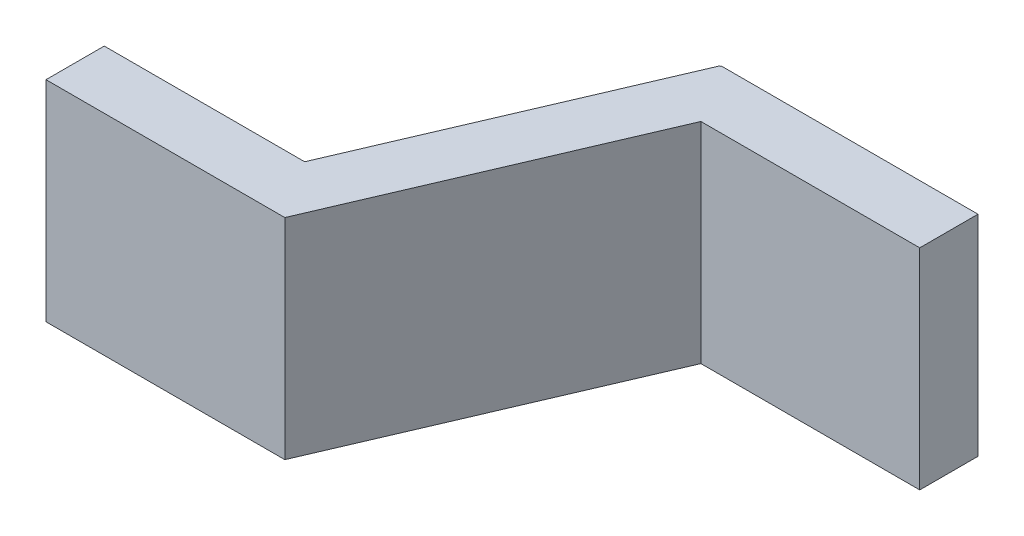
ISO-10303-21;
HEADER;
FILE_DESCRIPTION(('STEP AP214'),'2;1');
FILE_NAME('part.step','',(''),(''),'','','');
FILE_SCHEMA(('AUTOMOTIVE_DESIGN { 1 0 10303 214 1 1 1 1 }'));
ENDSEC;
DATA;
#1=APPLICATION_CONTEXT('core data for automotive mechanical design processes');
#2=APPLICATION_PROTOCOL_DEFINITION('international standard','automotive_design',2000,#1);
#3=PRODUCT_CONTEXT('',#1,'mechanical');
#4=PRODUCT('Part','Part','',(#3));
#5=PRODUCT_RELATED_PRODUCT_CATEGORY('part','',(#4));
#6=PRODUCT_DEFINITION_FORMATION('','',#4);
#7=PRODUCT_DEFINITION_CONTEXT('part definition',#1,'design');
#8=PRODUCT_DEFINITION('design','',#6,#7);
#9=PRODUCT_DEFINITION_SHAPE('','',#8);
#10=(LENGTH_UNIT() NAMED_UNIT(*) SI_UNIT(.MILLI.,.METRE.));
#11=(NAMED_UNIT(*) PLANE_ANGLE_UNIT() SI_UNIT($,.RADIAN.));
#12=(NAMED_UNIT(*) SI_UNIT($,.STERADIAN.) SOLID_ANGLE_UNIT());
#13=UNCERTAINTY_MEASURE_WITH_UNIT(LENGTH_MEASURE(1.E-05),#10,'distance_accuracy_value','');
#14=(GEOMETRIC_REPRESENTATION_CONTEXT(3) GLOBAL_UNCERTAINTY_ASSIGNED_CONTEXT((#13)) GLOBAL_UNIT_ASSIGNED_CONTEXT((#10,
#11,#12)) REPRESENTATION_CONTEXT('',''));
#15=CARTESIAN_POINT('',(0.,0.,0.));
#16=DIRECTION('',(0.,0.,1.));
#17=DIRECTION('',(1.,0.,0.));
#18=AXIS2_PLACEMENT_3D('',#15,#16,#17);
#19=CARTESIAN_POINT('',(11.558086453539,6.62,0.0006058345056003));
#20=DIRECTION('',(-0.919135450912914,0.,-0.393941649073963));
#21=DIRECTION('',(-0.393941649073963,0.,0.919135450912914));
#22=AXIS2_PLACEMENT_3D('',#19,#20,#21);
#23=PLANE('',#22);
#24=DIRECTION('',(0.,1.,0.));
#25=VECTOR('',#24,1.);
#26=CARTESIAN_POINT('',(11.344046008361,6.62,0.5));
#27=LINE('',#26,#25);
#28=CARTESIAN_POINT('',(11.344046008361,6.62,0.5));
#29=VERTEX_POINT('',#28);
#30=CARTESIAN_POINT('',(11.344046008361,6.980000014305,0.5));
#31=VERTEX_POINT('',#30);
#32=EDGE_CURVE('E94',#29,#31,#27,.T.);
#33=ORIENTED_EDGE('',*,*,#32,.T.);
#34=DIRECTION('',(-0.393941649073123,0.,0.919135450913275));
#35=VECTOR('',#34,1.);
#36=CARTESIAN_POINT('',(11.558086453539,6.980000014305,0.000605834505600302));
#37=LINE('',#36,#35);
#38=CARTESIAN_POINT('',(11.558086453539,6.980000014305,0.000605834505577237));
#39=VERTEX_POINT('',#38);
#40=EDGE_CURVE('E121',#39,#31,#37,.T.);
#41=ORIENTED_EDGE('',*,*,#40,.F.);
#42=DIRECTION('',(0.,1.,0.));
#43=VECTOR('',#42,1.);
#44=CARTESIAN_POINT('',(11.558086453539,6.62,0.000605834505554305));
#45=LINE('',#44,#43);
#46=CARTESIAN_POINT('',(11.558086453539,6.62,0.000605834505584969));
#47=VERTEX_POINT('',#46);
#48=EDGE_CURVE('E110',#39,#47,#45,.F.);
#49=ORIENTED_EDGE('',*,*,#48,.T.);
#50=DIRECTION('',(-0.393941649073123,0.,0.919135450913275));
#51=VECTOR('',#50,1.);
#52=CARTESIAN_POINT('',(11.558086453539,6.62,0.000605834505600302));
#53=LINE('',#52,#51);
#54=EDGE_CURVE('E100',#47,#29,#53,.T.);
#55=ORIENTED_EDGE('',*,*,#54,.T.);
#56=EDGE_LOOP('',(#33,#41,#49,#55));
#57=FACE_BOUND('',#56,.T.);
#58=ADVANCED_FACE('F17',(#57),#23,.T.);
#59=CARTESIAN_POINT('',(11.,6.62,0.5));
#60=DIRECTION('',(0.,0.,1.));
#61=DIRECTION('',(1.,0.,0.));
#62=AXIS2_PLACEMENT_3D('',#59,#60,#61);
#63=PLANE('',#62);
#64=DIRECTION('',(1.,0.,0.));
#65=VECTOR('',#64,1.);
#66=CARTESIAN_POINT('',(11.65,6.980000014305,0.5));
#67=LINE('',#66,#65);
#68=CARTESIAN_POINT('',(11.,6.980000014305,0.5));
#69=VERTEX_POINT('',#68);
#70=EDGE_CURVE('E79',#31,#69,#67,.F.);
#71=ORIENTED_EDGE('',*,*,#70,.F.);
#72=ORIENTED_EDGE('',*,*,#32,.F.);
#73=DIRECTION('',(1.,0.,0.));
#74=VECTOR('',#73,1.);
#75=CARTESIAN_POINT('',(11.65,6.62,0.5));
#76=LINE('',#75,#74);
#77=CARTESIAN_POINT('',(11.,6.62,0.5));
#78=VERTEX_POINT('',#77);
#79=EDGE_CURVE('E169',#29,#78,#76,.F.);
#80=ORIENTED_EDGE('',*,*,#79,.T.);
#81=DIRECTION('',(0.,1.,0.));
#82=VECTOR('',#81,1.);
#83=CARTESIAN_POINT('',(11.,6.62,0.5));
#84=LINE('',#83,#82);
#85=EDGE_CURVE('E87',#78,#69,#84,.T.);
#86=ORIENTED_EDGE('',*,*,#85,.T.);
#87=EDGE_LOOP('',(#71,#72,#80,#86));
#88=FACE_BOUND('',#87,.T.);
#89=ADVANCED_FACE('F198',(#88),#63,.F.);
#90=CARTESIAN_POINT('',(11.,6.62,0.5));
#91=DIRECTION('',(1.,0.,0.));
#92=DIRECTION('',(0.,0.,-1.));
#93=AXIS2_PLACEMENT_3D('',#90,#91,#92);
#94=PLANE('',#93);
#95=ORIENTED_EDGE('',*,*,#85,.F.);
#96=DIRECTION('',(0.,0.,1.));
#97=VECTOR('',#96,1.);
#98=CARTESIAN_POINT('',(11.,6.62,0.04));
#99=LINE('',#98,#97);
#100=CARTESIAN_POINT('',(11.,6.62,0.60000000149));
#101=VERTEX_POINT('',#100);
#102=EDGE_CURVE('E153',#78,#101,#99,.T.);
#103=ORIENTED_EDGE('',*,*,#102,.T.);
#104=DIRECTION('',(0.,1.,0.));
#105=VECTOR('',#104,1.);
#106=CARTESIAN_POINT('',(11.,6.62,0.60000000149));
#107=LINE('',#106,#105);
#108=CARTESIAN_POINT('',(11.,6.980000014305,0.60000000149));
#109=VERTEX_POINT('',#108);
#110=EDGE_CURVE('E117',#109,#101,#107,.F.);
#111=ORIENTED_EDGE('',*,*,#110,.F.);
#112=DIRECTION('',(0.,0.,1.));
#113=VECTOR('',#112,1.);
#114=CARTESIAN_POINT('',(11.,6.980000014305,0.04));
#115=LINE('',#114,#113);
#116=EDGE_CURVE('E71',#69,#109,#115,.T.);
#117=ORIENTED_EDGE('',*,*,#116,.F.);
#118=EDGE_LOOP('',(#95,#103,#111,#117));
#119=FACE_BOUND('',#118,.T.);
#120=ADVANCED_FACE('F202',(#119),#94,.F.);
#121=CARTESIAN_POINT('',(11.999999997616,6.62,0.));
#122=DIRECTION('',(1.,0.,0.));
#123=DIRECTION('',(0.,0.,-1.));
#124=AXIS2_PLACEMENT_3D('',#121,#122,#123);
#125=PLANE('',#124);
#126=DIRECTION('',(0.,0.,1.));
#127=VECTOR('',#126,1.);
#128=CARTESIAN_POINT('',(11.999999997616,6.62,0.04));
#129=LINE('',#128,#127);
#130=CARTESIAN_POINT('',(11.999999997616,6.62,0.10000000149));
#131=VERTEX_POINT('',#130);
#132=CARTESIAN_POINT('',(11.999999997616,6.62,0.));
#133=VERTEX_POINT('',#132);
#134=EDGE_CURVE('E179',#131,#133,#129,.F.);
#135=ORIENTED_EDGE('',*,*,#134,.T.);
#136=DIRECTION('',(0.,1.,0.));
#137=VECTOR('',#136,1.);
#138=CARTESIAN_POINT('',(11.999999997616,6.62,0.));
#139=LINE('',#138,#137);
#140=CARTESIAN_POINT('',(11.999999997616,6.980000014305,0.));
#141=VERTEX_POINT('',#140);
#142=EDGE_CURVE('E174',#133,#141,#139,.T.);
#143=ORIENTED_EDGE('',*,*,#142,.T.);
#144=DIRECTION('',(0.,0.,1.));
#145=VECTOR('',#144,1.);
#146=CARTESIAN_POINT('',(11.999999997616,6.980000014305,0.04));
#147=LINE('',#146,#145);
#148=CARTESIAN_POINT('',(11.999999997616,6.980000014305,0.10000000149));
#149=VERTEX_POINT('',#148);
#150=EDGE_CURVE('E155',#149,#141,#147,.F.);
#151=ORIENTED_EDGE('',*,*,#150,.F.);
#152=DIRECTION('',(0.,1.,0.));
#153=VECTOR('',#152,1.);
#154=CARTESIAN_POINT('',(11.999999997616,6.62,0.10000000149));
#155=LINE('',#154,#153);
#156=EDGE_CURVE('E125',#131,#149,#155,.T.);
#157=ORIENTED_EDGE('',*,*,#156,.F.);
#158=EDGE_LOOP('',(#135,#143,#151,#157));
#159=FACE_BOUND('',#158,.T.);
#160=ADVANCED_FACE('F228',(#159),#125,.T.);
#161=CARTESIAN_POINT('',(11.56,6.62,0.));
#162=DIRECTION('',(0.,0.,1.));
#163=DIRECTION('',(1.,0.,0.));
#164=AXIS2_PLACEMENT_3D('',#161,#162,#163);
#165=PLANE('',#164);
#166=DIRECTION('',(1.,0.,0.));
#167=VECTOR('',#166,1.);
#168=CARTESIAN_POINT('',(11.65,6.62,0.));
#169=LINE('',#168,#167);
#170=CARTESIAN_POINT('',(11.56,6.62,0.));
#171=VERTEX_POINT('',#170);
#172=EDGE_CURVE('E150',#133,#171,#169,.F.);
#173=ORIENTED_EDGE('',*,*,#172,.T.);
#174=DIRECTION('',(0.,1.,0.));
#175=VECTOR('',#174,1.);
#176=CARTESIAN_POINT('',(11.56,6.62,0.));
#177=LINE('',#176,#175);
#178=CARTESIAN_POINT('',(11.56,6.980000014305,0.));
#179=VERTEX_POINT('',#178);
#180=EDGE_CURVE('E164',#171,#179,#177,.T.);
#181=ORIENTED_EDGE('',*,*,#180,.T.);
#182=DIRECTION('',(1.,0.,0.));
#183=VECTOR('',#182,1.);
#184=CARTESIAN_POINT('',(11.65,6.980000014305,0.));
#185=LINE('',#184,#183);
#186=EDGE_CURVE('E154',#141,#179,#185,.F.);
#187=ORIENTED_EDGE('',*,*,#186,.F.);
#188=ORIENTED_EDGE('',*,*,#142,.F.);
#189=EDGE_LOOP('',(#173,#181,#187,#188));
#190=FACE_BOUND('',#189,.T.);
#191=ADVANCED_FACE('F232',(#190),#165,.F.);
#192=CARTESIAN_POINT('',(11.56,6.62,0.));
#193=DIRECTION('',(1.,0.,0.));
#194=DIRECTION('',(0.,0.,-1.));
#195=AXIS2_PLACEMENT_3D('',#192,#193,#194);
#196=PLANE('',#195);
#197=DIRECTION('',(0.,1.,0.));
#198=VECTOR('',#197,1.);
#199=CARTESIAN_POINT('',(11.56,6.62,0.00142598092431268));
#200=LINE('',#199,#198);
#201=CARTESIAN_POINT('',(11.56,6.62,0.00142598092431734));
#202=VERTEX_POINT('',#201);
#203=CARTESIAN_POINT('',(11.56,6.980000014305,0.00142598092431734));
#204=VERTEX_POINT('',#203);
#205=EDGE_CURVE('E118',#202,#204,#200,.T.);
#206=ORIENTED_EDGE('',*,*,#205,.T.);
#207=DIRECTION('',(0.,0.,1.));
#208=VECTOR('',#207,1.);
#209=CARTESIAN_POINT('',(11.56,6.980000014305,0.04));
#210=LINE('',#209,#208);
#211=EDGE_CURVE('E123',#179,#204,#210,.T.);
#212=ORIENTED_EDGE('',*,*,#211,.F.);
#213=ORIENTED_EDGE('',*,*,#180,.F.);
#214=DIRECTION('',(0.,0.,-1.));
#215=VECTOR('',#214,1.);
#216=CARTESIAN_POINT('',(11.56,6.62,0.));
#217=LINE('',#216,#215);
#218=EDGE_CURVE('E147',#171,#202,#217,.F.);
#219=ORIENTED_EDGE('',*,*,#218,.T.);
#220=EDGE_LOOP('',(#206,#212,#213,#219));
#221=FACE_BOUND('',#220,.T.);
#222=ADVANCED_FACE('F234',(#221),#196,.F.);
#223=CARTESIAN_POINT('',(11.65,6.62,0.04));
#224=DIRECTION('',(-0.393941649073963,0.,0.919135450912914));
#225=DIRECTION('',(0.919135450912914,0.,0.393941649073963));
#226=AXIS2_PLACEMENT_3D('',#223,#224,#225);
#227=PLANE('',#226);
#228=DIRECTION('',(-0.919135450920459,0.,-0.393941649056361));
#229=VECTOR('',#228,1.);
#230=CARTESIAN_POINT('',(11.56,6.980000014305,0.001425980924322));
#231=LINE('',#230,#229);
#232=EDGE_CURVE('E113',#204,#39,#231,.T.);
#233=ORIENTED_EDGE('',*,*,#232,.F.);
#234=ORIENTED_EDGE('',*,*,#205,.F.);
#235=DIRECTION('',(-0.919135450920459,0.,-0.393941649056361));
#236=VECTOR('',#235,1.);
#237=CARTESIAN_POINT('',(11.56,6.62,0.001425980924322));
#238=LINE('',#237,#236);
#239=EDGE_CURVE('E114',#202,#47,#238,.T.);
#240=ORIENTED_EDGE('',*,*,#239,.T.);
#241=ORIENTED_EDGE('',*,*,#48,.F.);
#242=EDGE_LOOP('',(#233,#234,#240,#241));
#243=FACE_BOUND('',#242,.T.);
#244=ADVANCED_FACE('F112',(#243),#227,.F.);
#245=CARTESIAN_POINT('',(11.,6.62,0.60000000149));
#246=DIRECTION('',(0.,0.,1.));
#247=DIRECTION('',(1.,0.,0.));
#248=AXIS2_PLACEMENT_3D('',#245,#246,#247);
#249=PLANE('',#248);
#250=DIRECTION('',(0.,1.,0.));
#251=VECTOR('',#250,1.);
#252=CARTESIAN_POINT('',(11.4099838806682,6.62,0.60000000149));
#253=LINE('',#252,#251);
#254=CARTESIAN_POINT('',(11.4099838806682,6.62,0.60000000149));
#255=VERTEX_POINT('',#254);
#256=CARTESIAN_POINT('',(11.4099838806682,6.980000014305,0.60000000149));
#257=VERTEX_POINT('',#256);
#258=EDGE_CURVE('E144',#255,#257,#253,.T.);
#259=ORIENTED_EDGE('',*,*,#258,.T.);
#260=DIRECTION('',(1.,0.,0.));
#261=VECTOR('',#260,1.);
#262=CARTESIAN_POINT('',(11.65,6.980000014305,0.60000000149));
#263=LINE('',#262,#261);
#264=EDGE_CURVE('E20',#109,#257,#263,.T.);
#265=ORIENTED_EDGE('',*,*,#264,.F.);
#266=ORIENTED_EDGE('',*,*,#110,.T.);
#267=DIRECTION('',(1.,0.,0.));
#268=VECTOR('',#267,1.);
#269=CARTESIAN_POINT('',(11.,6.62,0.60000000149));
#270=LINE('',#269,#268);
#271=EDGE_CURVE('E151',#101,#255,#270,.T.);
#272=ORIENTED_EDGE('',*,*,#271,.T.);
#273=EDGE_LOOP('',(#259,#265,#266,#272));
#274=FACE_BOUND('',#273,.T.);
#275=ADVANCED_FACE('F205',(#274),#249,.T.);
#276=CARTESIAN_POINT('',(11.65,6.980000014305,0.04));
#277=DIRECTION('',(0.,1.,0.));
#278=DIRECTION('',(0.,0.,1.));
#279=AXIS2_PLACEMENT_3D('',#276,#277,#278);
#280=PLANE('',#279);
#281=ORIENTED_EDGE('',*,*,#211,.T.);
#282=ORIENTED_EDGE('',*,*,#232,.T.);
#283=ORIENTED_EDGE('',*,*,#40,.T.);
#284=ORIENTED_EDGE('',*,*,#70,.T.);
#285=ORIENTED_EDGE('',*,*,#116,.T.);
#286=ORIENTED_EDGE('',*,*,#264,.T.);
#287=DIRECTION('',(-0.393941649073964,0.,0.919135450912914));
#288=VECTOR('',#287,1.);
#289=CARTESIAN_POINT('',(11.6242839866442,6.980000014305,0.100000001490094));
#290=LINE('',#289,#288);
#291=CARTESIAN_POINT('',(11.6242839866442,6.980000014305,0.100000001490047));
#292=VERTEX_POINT('',#291);
#293=EDGE_CURVE('E141',#257,#292,#290,.F.);
#294=ORIENTED_EDGE('',*,*,#293,.T.);
#295=DIRECTION('',(1.,0.,0.));
#296=VECTOR('',#295,1.);
#297=CARTESIAN_POINT('',(11.56,6.980000014305,0.10000000149));
#298=LINE('',#297,#296);
#299=EDGE_CURVE('E170',#149,#292,#298,.F.);
#300=ORIENTED_EDGE('',*,*,#299,.F.);
#301=ORIENTED_EDGE('',*,*,#150,.T.);
#302=ORIENTED_EDGE('',*,*,#186,.T.);
#303=EDGE_LOOP('',(#281,#282,#283,#284,#285,#286,#294,#300,#301,#302));
#304=FACE_BOUND('',#303,.T.);
#305=ADVANCED_FACE('F120',(#304),#280,.T.);
#306=CARTESIAN_POINT('',(11.56,6.62,0.10000000149));
#307=DIRECTION('',(0.,0.,1.));
#308=DIRECTION('',(1.,0.,0.));
#309=AXIS2_PLACEMENT_3D('',#306,#307,#308);
#310=PLANE('',#309);
#311=ORIENTED_EDGE('',*,*,#299,.T.);
#312=DIRECTION('',(0.,1.,0.));
#313=VECTOR('',#312,1.);
#314=CARTESIAN_POINT('',(11.6242839866442,6.62,0.100000001490094));
#315=LINE('',#314,#313);
#316=CARTESIAN_POINT('',(11.6242839866442,6.62,0.100000001490047));
#317=VERTEX_POINT('',#316);
#318=EDGE_CURVE('E26',#292,#317,#315,.F.);
#319=ORIENTED_EDGE('',*,*,#318,.T.);
#320=DIRECTION('',(1.,0.,0.));
#321=VECTOR('',#320,1.);
#322=CARTESIAN_POINT('',(11.65,6.62,0.10000000149));
#323=LINE('',#322,#321);
#324=EDGE_CURVE('E34',#317,#131,#323,.T.);
#325=ORIENTED_EDGE('',*,*,#324,.T.);
#326=ORIENTED_EDGE('',*,*,#156,.T.);
#327=EDGE_LOOP('',(#311,#319,#325,#326));
#328=FACE_BOUND('',#327,.T.);
#329=ADVANCED_FACE('F223',(#328),#310,.T.);
#330=CARTESIAN_POINT('',(11.65,6.62,0.04));
#331=DIRECTION('',(0.,1.,0.));
#332=DIRECTION('',(0.,0.,1.));
#333=AXIS2_PLACEMENT_3D('',#330,#331,#332);
#334=PLANE('',#333);
#335=ORIENTED_EDGE('',*,*,#218,.F.);
#336=ORIENTED_EDGE('',*,*,#172,.F.);
#337=ORIENTED_EDGE('',*,*,#134,.F.);
#338=ORIENTED_EDGE('',*,*,#324,.F.);
#339=DIRECTION('',(0.393941649073964,0.,-0.919135450912914));
#340=VECTOR('',#339,1.);
#341=CARTESIAN_POINT('',(11.4098164411035,6.62,0.600390667570103));
#342=LINE('',#341,#340);
#343=EDGE_CURVE('E11',#317,#255,#342,.F.);
#344=ORIENTED_EDGE('',*,*,#343,.T.);
#345=ORIENTED_EDGE('',*,*,#271,.F.);
#346=ORIENTED_EDGE('',*,*,#102,.F.);
#347=ORIENTED_EDGE('',*,*,#79,.F.);
#348=ORIENTED_EDGE('',*,*,#54,.F.);
#349=ORIENTED_EDGE('',*,*,#239,.F.);
#350=EDGE_LOOP('',(#335,#336,#337,#338,#344,#345,#346,#347,#348,#349));
#351=FACE_BOUND('',#350,.T.);
#352=ADVANCED_FACE('F200',(#351),#334,.F.);
#353=CARTESIAN_POINT('',(11.65,6.62,0.04));
#354=DIRECTION('',(-0.919135450912914,0.,-0.393941649073963));
#355=DIRECTION('',(-0.393941649073963,0.,0.919135450912914));
#356=AXIS2_PLACEMENT_3D('',#353,#354,#355);
#357=PLANE('',#356);
#358=ORIENTED_EDGE('',*,*,#318,.F.);
#359=ORIENTED_EDGE('',*,*,#293,.F.);
#360=ORIENTED_EDGE('',*,*,#258,.F.);
#361=ORIENTED_EDGE('',*,*,#343,.F.);
#362=EDGE_LOOP('',(#358,#359,#360,#361));
#363=FACE_BOUND('',#362,.T.);
#364=ADVANCED_FACE('F210',(#363),#357,.F.);
#365=CLOSED_SHELL('',(#58,#89,#120,#160,#191,#222,#244,#275,#305,#329,#352,#364));
#366=MANIFOLD_SOLID_BREP('B1',#365);
#367=ADVANCED_BREP_SHAPE_REPRESENTATION('',(#18,#366),#14);
#368=SHAPE_DEFINITION_REPRESENTATION(#9,#367);
ENDSEC;
END-ISO-10303-21;
